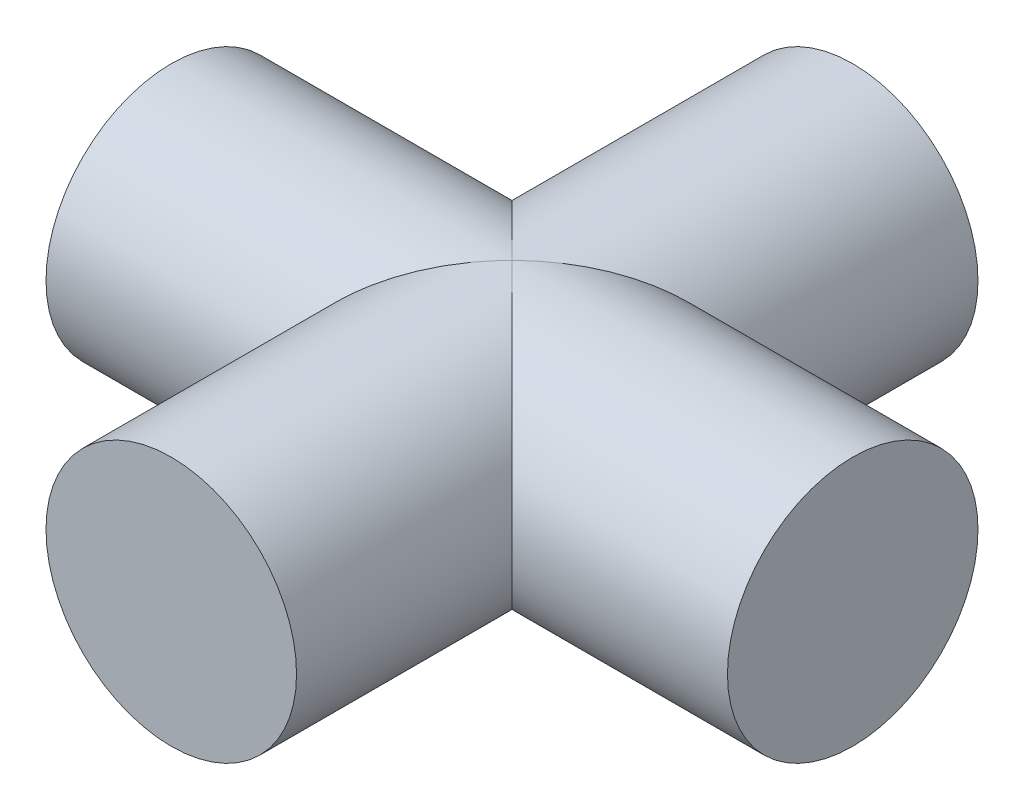
ISO-10303-21;
HEADER;
FILE_DESCRIPTION(('STEP AP214'),'2;1');
FILE_NAME('part.step','',(''),(''),'','','');
FILE_SCHEMA(('AUTOMOTIVE_DESIGN { 1 0 10303 214 1 1 1 1 }'));
ENDSEC;
DATA;
#1=APPLICATION_CONTEXT('core data for automotive mechanical design processes');
#2=APPLICATION_PROTOCOL_DEFINITION('international standard','automotive_design',2000,#1);
#3=PRODUCT_CONTEXT('',#1,'mechanical');
#4=PRODUCT('Part','Part','',(#3));
#5=PRODUCT_RELATED_PRODUCT_CATEGORY('part','',(#4));
#6=PRODUCT_DEFINITION_FORMATION('','',#4);
#7=PRODUCT_DEFINITION_CONTEXT('part definition',#1,'design');
#8=PRODUCT_DEFINITION('design','',#6,#7);
#9=PRODUCT_DEFINITION_SHAPE('','',#8);
#10=(LENGTH_UNIT() NAMED_UNIT(*) SI_UNIT(.MILLI.,.METRE.));
#11=(NAMED_UNIT(*) PLANE_ANGLE_UNIT() SI_UNIT($,.RADIAN.));
#12=(NAMED_UNIT(*) SI_UNIT($,.STERADIAN.) SOLID_ANGLE_UNIT());
#13=UNCERTAINTY_MEASURE_WITH_UNIT(LENGTH_MEASURE(1.E-05),#10,'distance_accuracy_value','');
#14=(GEOMETRIC_REPRESENTATION_CONTEXT(3) GLOBAL_UNCERTAINTY_ASSIGNED_CONTEXT((#13)) GLOBAL_UNIT_ASSIGNED_CONTEXT((#10,
#11,#12)) REPRESENTATION_CONTEXT('',''));
#15=CARTESIAN_POINT('',(0.,0.,0.));
#16=DIRECTION('',(0.,0.,1.));
#17=DIRECTION('',(1.,0.,0.));
#18=AXIS2_PLACEMENT_3D('',#15,#16,#17);
#19=CARTESIAN_POINT('',(0.,0.,68.));
#20=DIRECTION('',(0.,0.,-1.));
#21=DIRECTION('',(-1.,0.,0.));
#22=AXIS2_PLACEMENT_3D('',#19,#20,#21);
#23=CYLINDRICAL_SURFACE('',#22,12.5);
#24=CARTESIAN_POINT('',(0.,0.,34.));
#25=DIRECTION('',(-0.707106781186547,0.,-0.707106781186547));
#26=DIRECTION('',(0.707106781186547,0.,-0.707106781186547));
#27=AXIS2_PLACEMENT_3D('',#24,#25,#26);
#28=ELLIPSE('',#27,17.6776695296637,12.5);
#29=CARTESIAN_POINT('',(0.,12.5,34.));
#30=VERTEX_POINT('',#29);
#31=CARTESIAN_POINT('',(0.,-12.5,34.));
#32=VERTEX_POINT('',#31);
#33=EDGE_CURVE('E52',#30,#32,#28,.T.);
#34=ORIENTED_EDGE('',*,*,#33,.T.);
#35=CARTESIAN_POINT('',(0.,0.,34.));
#36=DIRECTION('',(0.707106781186547,0.,-0.707106781186547));
#37=DIRECTION('',(-0.707106781186547,0.,-0.707106781186547));
#38=AXIS2_PLACEMENT_3D('',#35,#36,#37);
#39=ELLIPSE('',#38,17.6776695296637,12.5);
#40=EDGE_CURVE('E41',#32,#30,#39,.T.);
#41=ORIENTED_EDGE('',*,*,#40,.T.);
#42=EDGE_LOOP('',(#34,#41));
#43=FACE_BOUND('',#42,.T.);
#44=CARTESIAN_POINT('',(0.,0.,0.));
#45=DIRECTION('',(0.,0.,1.));
#46=DIRECTION('',(1.,0.,0.));
#47=AXIS2_PLACEMENT_3D('',#44,#45,#46);
#48=CIRCLE('',#47,12.5);
#49=CARTESIAN_POINT('',(12.5,0.,0.));
#50=VERTEX_POINT('',#49);
#51=EDGE_CURVE('E64',#50,#50,#48,.T.);
#52=ORIENTED_EDGE('',*,*,#51,.T.);
#53=EDGE_LOOP('',(#52));
#54=FACE_BOUND('',#53,.T.);
#55=ADVANCED_FACE('F34',(#43,#54),#23,.T.);
#56=CARTESIAN_POINT('',(0.,0.,0.));
#57=DIRECTION('',(0.,0.,1.));
#58=DIRECTION('',(1.,0.,0.));
#59=AXIS2_PLACEMENT_3D('',#56,#57,#58);
#60=PLANE('',#59);
#61=ORIENTED_EDGE('',*,*,#51,.F.);
#62=EDGE_LOOP('',(#61));
#63=FACE_BOUND('',#62,.T.);
#64=ADVANCED_FACE('F91',(#63),#60,.F.);
#65=CARTESIAN_POINT('',(-34.,0.,34.));
#66=DIRECTION('',(1.,0.,0.));
#67=DIRECTION('',(0.,0.,-1.));
#68=AXIS2_PLACEMENT_3D('',#65,#66,#67);
#69=PLANE('',#68);
#70=CARTESIAN_POINT('',(-34.,0.,34.));
#71=DIRECTION('',(1.,0.,0.));
#72=DIRECTION('',(0.,0.,-1.));
#73=AXIS2_PLACEMENT_3D('',#70,#71,#72);
#74=CIRCLE('',#73,12.5);
#75=CARTESIAN_POINT('',(-34.,0.,21.5));
#76=VERTEX_POINT('',#75);
#77=EDGE_CURVE('E67',#76,#76,#74,.T.);
#78=ORIENTED_EDGE('',*,*,#77,.F.);
#79=EDGE_LOOP('',(#78));
#80=FACE_BOUND('',#79,.T.);
#81=ADVANCED_FACE('F86',(#80),#69,.F.);
#82=CARTESIAN_POINT('',(-34.,0.,34.));
#83=DIRECTION('',(1.,0.,0.));
#84=DIRECTION('',(0.,0.,-1.));
#85=AXIS2_PLACEMENT_3D('',#82,#83,#84);
#86=CYLINDRICAL_SURFACE('',#85,12.5);
#87=ORIENTED_EDGE('',*,*,#77,.T.);
#88=EDGE_LOOP('',(#87));
#89=FACE_BOUND('',#88,.T.);
#90=ORIENTED_EDGE('',*,*,#40,.F.);
#91=CARTESIAN_POINT('',(0.,0.,34.));
#92=DIRECTION('',(-0.707106781186547,0.,-0.707106781186547));
#93=DIRECTION('',(0.707106781186547,0.,-0.707106781186547));
#94=AXIS2_PLACEMENT_3D('',#91,#92,#93);
#95=ELLIPSE('',#94,17.6776695296637,12.5);
#96=EDGE_CURVE('E46',#30,#32,#95,.F.);
#97=ORIENTED_EDGE('',*,*,#96,.F.);
#98=EDGE_LOOP('',(#90,#97));
#99=FACE_BOUND('',#98,.T.);
#100=ADVANCED_FACE('F58',(#89,#99),#86,.T.);
#101=CARTESIAN_POINT('',(34.,0.,34.));
#102=DIRECTION('',(1.,0.,0.));
#103=DIRECTION('',(0.,0.,-1.));
#104=AXIS2_PLACEMENT_3D('',#101,#102,#103);
#105=CIRCLE('',#104,12.5);
#106=CARTESIAN_POINT('',(34.,0.,21.5));
#107=VERTEX_POINT('',#106);
#108=EDGE_CURVE('E72',#107,#107,#105,.T.);
#109=ORIENTED_EDGE('',*,*,#108,.F.);
#110=EDGE_LOOP('',(#109));
#111=FACE_BOUND('',#110,.T.);
#112=CARTESIAN_POINT('',(0.,0.,34.));
#113=DIRECTION('',(0.707106781186547,0.,-0.707106781186547));
#114=DIRECTION('',(-0.707106781186547,0.,-0.707106781186547));
#115=AXIS2_PLACEMENT_3D('',#112,#113,#114);
#116=ELLIPSE('',#115,17.6776695296637,12.5);
#117=EDGE_CURVE('E11',#32,#30,#116,.F.);
#118=ORIENTED_EDGE('',*,*,#117,.F.);
#119=ORIENTED_EDGE('',*,*,#33,.F.);
#120=EDGE_LOOP('',(#118,#119));
#121=FACE_BOUND('',#120,.T.);
#122=ADVANCED_FACE('F53',(#111,#121),#86,.T.);
#123=CARTESIAN_POINT('',(34.,0.,34.));
#124=DIRECTION('',(1.,0.,0.));
#125=DIRECTION('',(0.,0.,-1.));
#126=AXIS2_PLACEMENT_3D('',#123,#124,#125);
#127=PLANE('',#126);
#128=ORIENTED_EDGE('',*,*,#108,.T.);
#129=EDGE_LOOP('',(#128));
#130=FACE_BOUND('',#129,.T.);
#131=ADVANCED_FACE('F76',(#130),#127,.T.);
#132=CARTESIAN_POINT('',(0.,0.,68.));
#133=DIRECTION('',(0.,0.,1.));
#134=DIRECTION('',(1.,0.,0.));
#135=AXIS2_PLACEMENT_3D('',#132,#133,#134);
#136=PLANE('',#135);
#137=CARTESIAN_POINT('',(0.,0.,68.));
#138=DIRECTION('',(0.,0.,1.));
#139=DIRECTION('',(1.,0.,0.));
#140=AXIS2_PLACEMENT_3D('',#137,#138,#139);
#141=CIRCLE('',#140,12.5);
#142=CARTESIAN_POINT('',(12.5,0.,68.));
#143=VERTEX_POINT('',#142);
#144=EDGE_CURVE('E59',#143,#143,#141,.T.);
#145=ORIENTED_EDGE('',*,*,#144,.T.);
#146=EDGE_LOOP('',(#145));
#147=FACE_BOUND('',#146,.T.);
#148=ADVANCED_FACE('F84',(#147),#136,.T.);
#149=ORIENTED_EDGE('',*,*,#144,.F.);
#150=EDGE_LOOP('',(#149));
#151=FACE_BOUND('',#150,.T.);
#152=ORIENTED_EDGE('',*,*,#96,.T.);
#153=ORIENTED_EDGE('',*,*,#117,.T.);
#154=EDGE_LOOP('',(#152,#153));
#155=FACE_BOUND('',#154,.T.);
#156=ADVANCED_FACE('F61',(#151,#155),#23,.T.);
#157=CLOSED_SHELL('',(#55,#64,#81,#100,#122,#131,#148,#156));
#158=MANIFOLD_SOLID_BREP('B2',#157);
#159=ADVANCED_BREP_SHAPE_REPRESENTATION('',(#18,#158),#14);
#160=SHAPE_DEFINITION_REPRESENTATION(#9,#159);
ENDSEC;
END-ISO-10303-21;
